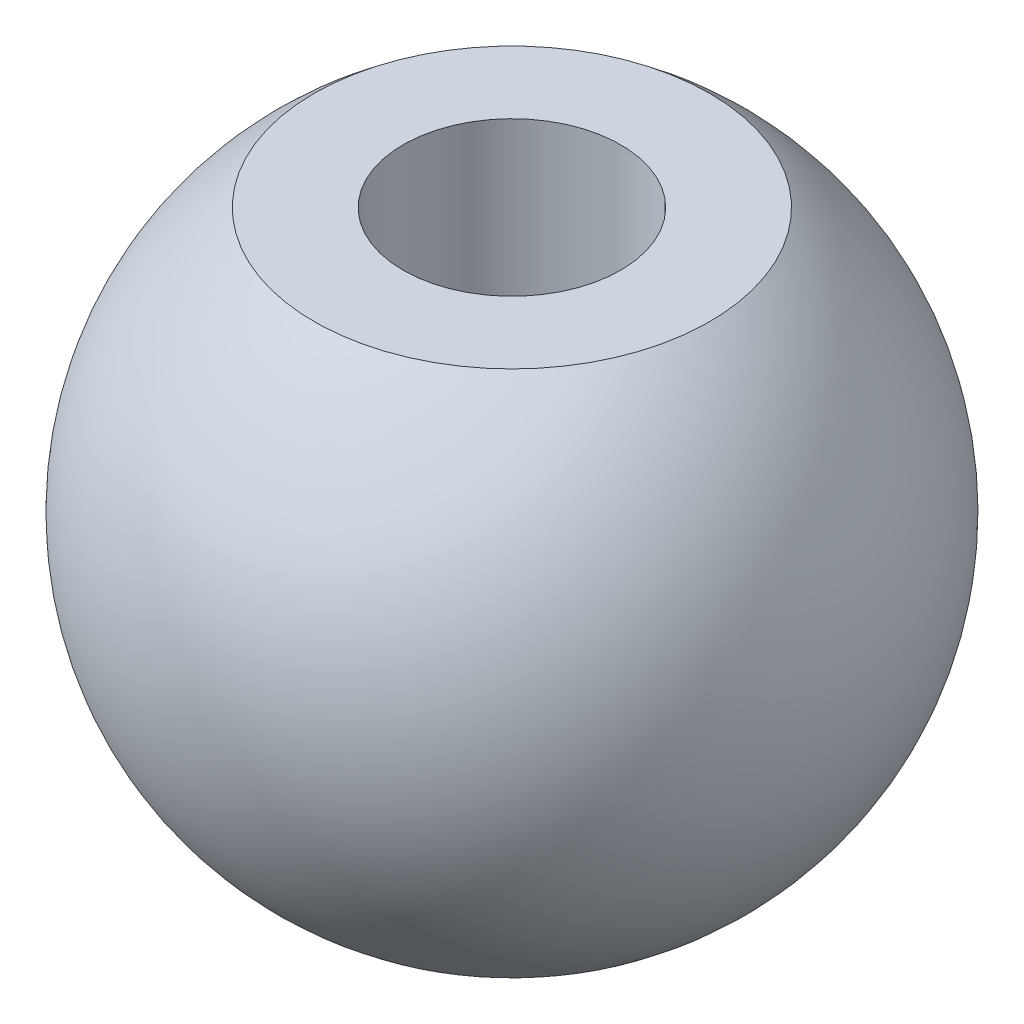
ISO-10303-21;
HEADER;
FILE_DESCRIPTION(('STEP AP214'),'2;1');
FILE_NAME('part.step','',(''),(''),'','','');
FILE_SCHEMA(('AUTOMOTIVE_DESIGN { 1 0 10303 214 1 1 1 1 }'));
ENDSEC;
DATA;
#1=APPLICATION_CONTEXT('core data for automotive mechanical design processes');
#2=APPLICATION_PROTOCOL_DEFINITION('international standard','automotive_design',2000,#1);
#3=PRODUCT_CONTEXT('',#1,'mechanical');
#4=PRODUCT('Part','Part','',(#3));
#5=PRODUCT_RELATED_PRODUCT_CATEGORY('part','',(#4));
#6=PRODUCT_DEFINITION_FORMATION('','',#4);
#7=PRODUCT_DEFINITION_CONTEXT('part definition',#1,'design');
#8=PRODUCT_DEFINITION('design','',#6,#7);
#9=PRODUCT_DEFINITION_SHAPE('','',#8);
#10=(LENGTH_UNIT() NAMED_UNIT(*) SI_UNIT(.MILLI.,.METRE.));
#11=(NAMED_UNIT(*) PLANE_ANGLE_UNIT() SI_UNIT($,.RADIAN.));
#12=(NAMED_UNIT(*) SI_UNIT($,.STERADIAN.) SOLID_ANGLE_UNIT());
#13=UNCERTAINTY_MEASURE_WITH_UNIT(LENGTH_MEASURE(1.E-05),#10,'distance_accuracy_value','');
#14=(GEOMETRIC_REPRESENTATION_CONTEXT(3) GLOBAL_UNCERTAINTY_ASSIGNED_CONTEXT((#13)) GLOBAL_UNIT_ASSIGNED_CONTEXT((#10,
#11,#12)) REPRESENTATION_CONTEXT('',''));
#15=CARTESIAN_POINT('',(0.,0.,0.));
#16=DIRECTION('',(0.,0.,1.));
#17=DIRECTION('',(1.,0.,0.));
#18=AXIS2_PLACEMENT_3D('',#15,#16,#17);
#19=CARTESIAN_POINT('',(0.,5.,0.));
#20=DIRECTION('',(0.,-1.,0.));
#21=DIRECTION('',(-1.,0.,0.));
#22=AXIS2_PLACEMENT_3D('',#19,#20,#21);
#23=SPHERICAL_SURFACE('',#22,5.);
#24=CARTESIAN_POINT('',(0.,9.,0.));
#25=DIRECTION('',(0.,-1.,0.));
#26=DIRECTION('',(0.,0.,-1.));
#27=AXIS2_PLACEMENT_3D('',#24,#25,#26);
#28=CIRCLE('',#27,3.);
#29=CARTESIAN_POINT('',(0.,9.,-3.));
#30=VERTEX_POINT('',#29);
#31=EDGE_CURVE('E11',#30,#30,#28,.T.);
#32=ORIENTED_EDGE('',*,*,#31,.T.);
#33=EDGE_LOOP('',(#32));
#34=FACE_BOUND('',#33,.T.);
#35=ADVANCED_FACE('F34',(#34),#23,.T.);
#36=CARTESIAN_POINT('',(0.,9.,0.));
#37=DIRECTION('',(0.,1.,0.));
#38=DIRECTION('',(0.,0.,1.));
#39=AXIS2_PLACEMENT_3D('',#36,#37,#38);
#40=PLANE('',#39);
#41=CARTESIAN_POINT('',(0.,9.,0.));
#42=DIRECTION('',(0.,1.,0.));
#43=DIRECTION('',(0.,0.,1.));
#44=AXIS2_PLACEMENT_3D('',#41,#42,#43);
#45=CIRCLE('',#44,1.64999999999999);
#46=CARTESIAN_POINT('',(0.,9.,1.64999999999999));
#47=VERTEX_POINT('',#46);
#48=EDGE_CURVE('E52',#47,#47,#45,.T.);
#49=ORIENTED_EDGE('',*,*,#48,.F.);
#50=EDGE_LOOP('',(#49));
#51=FACE_BOUND('',#50,.T.);
#52=ORIENTED_EDGE('',*,*,#31,.F.);
#53=EDGE_LOOP('',(#52));
#54=FACE_BOUND('',#53,.T.);
#55=ADVANCED_FACE('F47',(#51,#54),#40,.T.);
#56=CARTESIAN_POINT('',(0.,3.,0.));
#57=DIRECTION('',(0.,1.,0.));
#58=DIRECTION('',(0.,0.,1.));
#59=AXIS2_PLACEMENT_3D('',#56,#57,#58);
#60=CONICAL_SURFACE('',#59,1.65,1.02974425867665);
#61=CARTESIAN_POINT('',(0.,2.00857997860453,0.));
#62=VERTEX_POINT('',#61);
#63=VERTEX_LOOP('',#62);
#64=FACE_BOUND('',#63,.T.);
#65=CARTESIAN_POINT('',(0.,3.,0.));
#66=DIRECTION('',(0.,1.,0.));
#67=DIRECTION('',(0.,0.,1.));
#68=AXIS2_PLACEMENT_3D('',#65,#66,#67);
#69=CIRCLE('',#68,1.65);
#70=CARTESIAN_POINT('',(0.,3.,1.65));
#71=VERTEX_POINT('',#70);
#72=EDGE_CURVE('E40',#71,#71,#69,.T.);
#73=ORIENTED_EDGE('',*,*,#72,.T.);
#74=EDGE_LOOP('',(#73));
#75=FACE_BOUND('',#74,.T.);
#76=ADVANCED_FACE('F43',(#64,#75),#60,.F.);
#77=CARTESIAN_POINT('',(0.,9.,0.));
#78=DIRECTION('',(0.,1.,0.));
#79=DIRECTION('',(0.,0.,1.));
#80=AXIS2_PLACEMENT_3D('',#77,#78,#79);
#81=CYLINDRICAL_SURFACE('',#80,1.64999999999999);
#82=ORIENTED_EDGE('',*,*,#72,.F.);
#83=EDGE_LOOP('',(#82));
#84=FACE_BOUND('',#83,.T.);
#85=ORIENTED_EDGE('',*,*,#48,.T.);
#86=EDGE_LOOP('',(#85));
#87=FACE_BOUND('',#86,.T.);
#88=ADVANCED_FACE('F46',(#84,#87),#81,.F.);
#89=CLOSED_SHELL('',(#35,#55,#76,#88));
#90=MANIFOLD_SOLID_BREP('B2',#89);
#91=ADVANCED_BREP_SHAPE_REPRESENTATION('',(#18,#90),#14);
#92=SHAPE_DEFINITION_REPRESENTATION(#9,#91);
ENDSEC;
END-ISO-10303-21;
